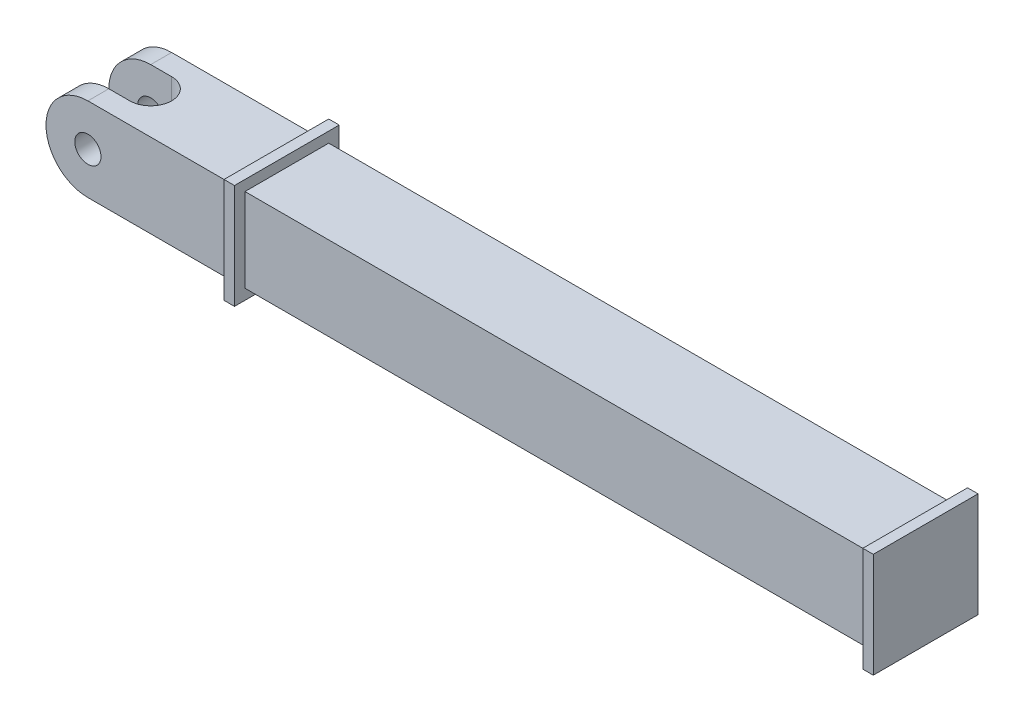
ISO-10303-21;
HEADER;
FILE_DESCRIPTION(('STEP AP214'),'2;1');
FILE_NAME('part.step','',(''),(''),'','','');
FILE_SCHEMA(('AUTOMOTIVE_DESIGN { 1 0 10303 214 1 1 1 1 }'));
ENDSEC;
DATA;
#1=APPLICATION_CONTEXT('core data for automotive mechanical design processes');
#2=APPLICATION_PROTOCOL_DEFINITION('international standard','automotive_design',2000,#1);
#3=PRODUCT_CONTEXT('',#1,'mechanical');
#4=PRODUCT('Part','Part','',(#3));
#5=PRODUCT_RELATED_PRODUCT_CATEGORY('part','',(#4));
#6=PRODUCT_DEFINITION_FORMATION('','',#4);
#7=PRODUCT_DEFINITION_CONTEXT('part definition',#1,'design');
#8=PRODUCT_DEFINITION('design','',#6,#7);
#9=PRODUCT_DEFINITION_SHAPE('','',#8);
#10=(LENGTH_UNIT() NAMED_UNIT(*) SI_UNIT(.MILLI.,.METRE.));
#11=(NAMED_UNIT(*) PLANE_ANGLE_UNIT() SI_UNIT($,.RADIAN.));
#12=(NAMED_UNIT(*) SI_UNIT($,.STERADIAN.) SOLID_ANGLE_UNIT());
#13=UNCERTAINTY_MEASURE_WITH_UNIT(LENGTH_MEASURE(1.E-05),#10,'distance_accuracy_value','');
#14=(GEOMETRIC_REPRESENTATION_CONTEXT(3) GLOBAL_UNCERTAINTY_ASSIGNED_CONTEXT((#13)) GLOBAL_UNIT_ASSIGNED_CONTEXT((#10,
#11,#12)) REPRESENTATION_CONTEXT('',''));
#15=CARTESIAN_POINT('',(0.,0.,0.));
#16=DIRECTION('',(0.,0.,1.));
#17=DIRECTION('',(1.,0.,0.));
#18=AXIS2_PLACEMENT_3D('',#15,#16,#17);
#19=CARTESIAN_POINT('',(0.,80.,0.));
#20=DIRECTION('',(0.,-1.,0.));
#21=DIRECTION('',(0.,0.,-1.));
#22=AXIS2_PLACEMENT_3D('',#19,#20,#21);
#23=PLANE('',#22);
#24=DIRECTION('',(1.,0.,0.));
#25=VECTOR('',#24,1.);
#26=CARTESIAN_POINT('',(-470.,80.,-20.));
#27=LINE('',#26,#25);
#28=CARTESIAN_POINT('',(-430.,80.,-20.));
#29=VERTEX_POINT('',#28);
#30=CARTESIAN_POINT('',(-410.,80.,-20.));
#31=VERTEX_POINT('',#30);
#32=EDGE_CURVE('E210',#29,#31,#27,.T.);
#33=ORIENTED_EDGE('',*,*,#32,.T.);
#34=CARTESIAN_POINT('',(-410.,80.,0.));
#35=DIRECTION('',(0.,-1.,0.));
#36=DIRECTION('',(0.,0.,-1.));
#37=AXIS2_PLACEMENT_3D('',#34,#35,#36);
#38=CIRCLE('',#37,20.);
#39=CARTESIAN_POINT('',(-410.,80.,19.9999999999999));
#40=VERTEX_POINT('',#39);
#41=EDGE_CURVE('E190',#31,#40,#38,.T.);
#42=ORIENTED_EDGE('',*,*,#41,.T.);
#43=DIRECTION('',(-1.,0.,0.));
#44=VECTOR('',#43,1.);
#45=CARTESIAN_POINT('',(-410.,80.,19.9999999999999));
#46=LINE('',#45,#44);
#47=CARTESIAN_POINT('',(-430.,80.,19.9999999999999));
#48=VERTEX_POINT('',#47);
#49=EDGE_CURVE('E186',#40,#48,#46,.T.);
#50=ORIENTED_EDGE('',*,*,#49,.T.);
#51=DIRECTION('',(0.,0.,1.));
#52=VECTOR('',#51,1.);
#53=CARTESIAN_POINT('',(-430.,80.,-153.137084989848));
#54=LINE('',#53,#52);
#55=CARTESIAN_POINT('',(-430.,80.,40.));
#56=VERTEX_POINT('',#55);
#57=EDGE_CURVE('E226',#48,#56,#54,.T.);
#58=ORIENTED_EDGE('',*,*,#57,.T.);
#59=DIRECTION('',(1.,0.,0.));
#60=VECTOR('',#59,1.);
#61=CARTESIAN_POINT('',(-330.,80.,40.));
#62=LINE('',#61,#60);
#63=CARTESIAN_POINT('',(-290.,80.,40.));
#64=VERTEX_POINT('',#63);
#65=EDGE_CURVE('E321',#56,#64,#62,.T.);
#66=ORIENTED_EDGE('',*,*,#65,.T.);
#67=DIRECTION('',(0.,0.,-1.));
#68=VECTOR('',#67,1.);
#69=CARTESIAN_POINT('',(-290.,80.,0.));
#70=LINE('',#69,#68);
#71=CARTESIAN_POINT('',(-290.,80.,-40.));
#72=VERTEX_POINT('',#71);
#73=EDGE_CURVE('E54',#64,#72,#70,.T.);
#74=ORIENTED_EDGE('',*,*,#73,.T.);
#75=DIRECTION('',(-1.,0.,0.));
#76=VECTOR('',#75,1.);
#77=CARTESIAN_POINT('',(-330.,80.,-40.));
#78=LINE('',#77,#76);
#79=CARTESIAN_POINT('',(-430.,80.,-40.));
#80=VERTEX_POINT('',#79);
#81=EDGE_CURVE('E320',#72,#80,#78,.T.);
#82=ORIENTED_EDGE('',*,*,#81,.T.);
#83=EDGE_CURVE('E229',#80,#29,#54,.T.);
#84=ORIENTED_EDGE('',*,*,#83,.T.);
#85=EDGE_LOOP('',(#33,#42,#50,#58,#66,#74,#82,#84));
#86=FACE_BOUND('',#85,.T.);
#87=ADVANCED_FACE('F37',(#86),#23,.F.);
#88=CARTESIAN_POINT('',(0.,0.,0.));
#89=DIRECTION('',(0.,-1.,0.));
#90=DIRECTION('',(0.,0.,-1.));
#91=AXIS2_PLACEMENT_3D('',#88,#89,#90);
#92=PLANE('',#91);
#93=CARTESIAN_POINT('',(-410.,0.,0.));
#94=DIRECTION('',(0.,-1.,0.));
#95=DIRECTION('',(0.,0.,-1.));
#96=AXIS2_PLACEMENT_3D('',#93,#94,#95);
#97=CIRCLE('',#96,20.);
#98=CARTESIAN_POINT('',(-410.,0.,-20.));
#99=VERTEX_POINT('',#98);
#100=CARTESIAN_POINT('',(-410.,0.,19.9999999999999));
#101=VERTEX_POINT('',#100);
#102=EDGE_CURVE('E194',#99,#101,#97,.T.);
#103=ORIENTED_EDGE('',*,*,#102,.F.);
#104=DIRECTION('',(1.,0.,0.));
#105=VECTOR('',#104,1.);
#106=CARTESIAN_POINT('',(-470.,0.,-20.));
#107=LINE('',#106,#105);
#108=CARTESIAN_POINT('',(-430.,0.,-20.));
#109=VERTEX_POINT('',#108);
#110=EDGE_CURVE('E199',#109,#99,#107,.T.);
#111=ORIENTED_EDGE('',*,*,#110,.F.);
#112=DIRECTION('',(0.,0.,1.));
#113=VECTOR('',#112,1.);
#114=CARTESIAN_POINT('',(-430.,0.,-153.137084989848));
#115=LINE('',#114,#113);
#116=CARTESIAN_POINT('',(-430.,0.,-40.));
#117=VERTEX_POINT('',#116);
#118=EDGE_CURVE('E220',#117,#109,#115,.T.);
#119=ORIENTED_EDGE('',*,*,#118,.F.);
#120=DIRECTION('',(-1.,0.,0.));
#121=VECTOR('',#120,1.);
#122=CARTESIAN_POINT('',(-330.,0.,-40.));
#123=LINE('',#122,#121);
#124=CARTESIAN_POINT('',(-290.,0.,-40.));
#125=VERTEX_POINT('',#124);
#126=EDGE_CURVE('E315',#125,#117,#123,.T.);
#127=ORIENTED_EDGE('',*,*,#126,.F.);
#128=DIRECTION('',(0.,0.,-1.));
#129=VECTOR('',#128,1.);
#130=CARTESIAN_POINT('',(-290.,0.,0.));
#131=LINE('',#130,#129);
#132=CARTESIAN_POINT('',(-290.,0.,40.));
#133=VERTEX_POINT('',#132);
#134=EDGE_CURVE('E11',#133,#125,#131,.T.);
#135=ORIENTED_EDGE('',*,*,#134,.F.);
#136=DIRECTION('',(1.,0.,0.));
#137=VECTOR('',#136,1.);
#138=CARTESIAN_POINT('',(-330.,0.,40.));
#139=LINE('',#138,#137);
#140=CARTESIAN_POINT('',(-430.,0.,40.));
#141=VERTEX_POINT('',#140);
#142=EDGE_CURVE('E328',#141,#133,#139,.T.);
#143=ORIENTED_EDGE('',*,*,#142,.F.);
#144=CARTESIAN_POINT('',(-430.,0.,19.9999999999999));
#145=VERTEX_POINT('',#144);
#146=EDGE_CURVE('E203',#145,#141,#115,.T.);
#147=ORIENTED_EDGE('',*,*,#146,.F.);
#148=DIRECTION('',(-1.,0.,0.));
#149=VECTOR('',#148,1.);
#150=CARTESIAN_POINT('',(-410.,0.,19.9999999999999));
#151=LINE('',#150,#149);
#152=EDGE_CURVE('E183',#101,#145,#151,.T.);
#153=ORIENTED_EDGE('',*,*,#152,.F.);
#154=EDGE_LOOP('',(#103,#111,#119,#127,#135,#143,#147,#153));
#155=FACE_BOUND('',#154,.T.);
#156=ADVANCED_FACE('F201',(#155),#92,.T.);
#157=CARTESIAN_POINT('',(-430.,40.,-153.137084989848));
#158=DIRECTION('',(0.,0.,1.));
#159=DIRECTION('',(1.,0.,0.));
#160=AXIS2_PLACEMENT_3D('',#157,#158,#159);
#161=CYLINDRICAL_SURFACE('',#160,40.);
#162=ORIENTED_EDGE('',*,*,#118,.T.);
#163=CARTESIAN_POINT('',(-430.,40.,-20.));
#164=DIRECTION('',(0.,0.,1.));
#165=DIRECTION('',(1.,0.,0.));
#166=AXIS2_PLACEMENT_3D('',#163,#164,#165);
#167=CIRCLE('',#166,40.);
#168=EDGE_CURVE('E213',#109,#29,#167,.F.);
#169=ORIENTED_EDGE('',*,*,#168,.T.);
#170=ORIENTED_EDGE('',*,*,#83,.F.);
#171=CARTESIAN_POINT('',(-430.,40.,-40.));
#172=DIRECTION('',(0.,0.,1.));
#173=DIRECTION('',(1.,0.,0.));
#174=AXIS2_PLACEMENT_3D('',#171,#172,#173);
#175=CIRCLE('',#174,40.);
#176=EDGE_CURVE('E216',#117,#80,#175,.F.);
#177=ORIENTED_EDGE('',*,*,#176,.F.);
#178=EDGE_LOOP('',(#162,#169,#170,#177));
#179=FACE_BOUND('',#178,.T.);
#180=ADVANCED_FACE('F369',(#179),#161,.T.);
#181=CARTESIAN_POINT('',(-430.,40.,19.9999999999999));
#182=DIRECTION('',(0.,0.,-1.));
#183=DIRECTION('',(-1.,0.,0.));
#184=AXIS2_PLACEMENT_3D('',#181,#182,#183);
#185=CIRCLE('',#184,40.);
#186=EDGE_CURVE('E207',#48,#145,#185,.F.);
#187=ORIENTED_EDGE('',*,*,#186,.T.);
#188=ORIENTED_EDGE('',*,*,#146,.T.);
#189=CARTESIAN_POINT('',(-430.,40.,40.));
#190=DIRECTION('',(0.,0.,1.));
#191=DIRECTION('',(1.,0.,0.));
#192=AXIS2_PLACEMENT_3D('',#189,#190,#191);
#193=CIRCLE('',#192,40.);
#194=EDGE_CURVE('E215',#56,#141,#193,.T.);
#195=ORIENTED_EDGE('',*,*,#194,.F.);
#196=ORIENTED_EDGE('',*,*,#57,.F.);
#197=EDGE_LOOP('',(#187,#188,#195,#196));
#198=FACE_BOUND('',#197,.T.);
#199=ADVANCED_FACE('F569',(#198),#161,.T.);
#200=CARTESIAN_POINT('',(-430.,40.,-153.137084989848));
#201=DIRECTION('',(0.,0.,1.));
#202=DIRECTION('',(1.,0.,0.));
#203=AXIS2_PLACEMENT_3D('',#200,#201,#202);
#204=CYLINDRICAL_SURFACE('',#203,12.5);
#205=CARTESIAN_POINT('',(-430.,40.,-40.));
#206=DIRECTION('',(0.,0.,1.));
#207=DIRECTION('',(1.,0.,0.));
#208=AXIS2_PLACEMENT_3D('',#205,#206,#207);
#209=CIRCLE('',#208,12.5);
#210=CARTESIAN_POINT('',(-417.5,40.,-40.));
#211=VERTEX_POINT('',#210);
#212=EDGE_CURVE('E219',#211,#211,#209,.F.);
#213=ORIENTED_EDGE('',*,*,#212,.T.);
#214=EDGE_LOOP('',(#213));
#215=FACE_BOUND('',#214,.T.);
#216=CARTESIAN_POINT('',(-430.,40.,-20.));
#217=DIRECTION('',(0.,0.,1.));
#218=DIRECTION('',(1.,0.,0.));
#219=AXIS2_PLACEMENT_3D('',#216,#217,#218);
#220=CIRCLE('',#219,12.5);
#221=CARTESIAN_POINT('',(-417.5,40.,-20.));
#222=VERTEX_POINT('',#221);
#223=EDGE_CURVE('E41',#222,#222,#220,.F.);
#224=ORIENTED_EDGE('',*,*,#223,.F.);
#225=EDGE_LOOP('',(#224));
#226=FACE_BOUND('',#225,.T.);
#227=ADVANCED_FACE('F578',(#215,#226),#204,.F.);
#228=CARTESIAN_POINT('',(-430.,40.,40.));
#229=DIRECTION('',(0.,0.,1.));
#230=DIRECTION('',(1.,0.,0.));
#231=AXIS2_PLACEMENT_3D('',#228,#229,#230);
#232=CIRCLE('',#231,12.5);
#233=CARTESIAN_POINT('',(-417.5,40.,40.));
#234=VERTEX_POINT('',#233);
#235=EDGE_CURVE('E223',#234,#234,#232,.T.);
#236=ORIENTED_EDGE('',*,*,#235,.T.);
#237=EDGE_LOOP('',(#236));
#238=FACE_BOUND('',#237,.T.);
#239=CARTESIAN_POINT('',(-430.,40.,19.9999999999999));
#240=DIRECTION('',(0.,0.,-1.));
#241=DIRECTION('',(-1.,0.,0.));
#242=AXIS2_PLACEMENT_3D('',#239,#240,#241);
#243=CIRCLE('',#242,12.5);
#244=CARTESIAN_POINT('',(-442.5,40.,19.9999999999999));
#245=VERTEX_POINT('',#244);
#246=EDGE_CURVE('E204',#245,#245,#243,.F.);
#247=ORIENTED_EDGE('',*,*,#246,.F.);
#248=EDGE_LOOP('',(#247));
#249=FACE_BOUND('',#248,.T.);
#250=ADVANCED_FACE('F478',(#238,#249),#204,.F.);
#251=CARTESIAN_POINT('',(-330.,80.,-40.));
#252=DIRECTION('',(0.,0.,1.));
#253=DIRECTION('',(1.,0.,0.));
#254=AXIS2_PLACEMENT_3D('',#251,#252,#253);
#255=PLANE('',#254);
#256=DIRECTION('',(0.,-1.,0.));
#257=VECTOR('',#256,1.);
#258=CARTESIAN_POINT('',(-280.,80.,-40.));
#259=LINE('',#258,#257);
#260=CARTESIAN_POINT('',(-280.,80.,-40.));
#261=VERTEX_POINT('',#260);
#262=CARTESIAN_POINT('',(-280.,0.,-40.));
#263=VERTEX_POINT('',#262);
#264=EDGE_CURVE('E268',#261,#263,#259,.T.);
#265=ORIENTED_EDGE('',*,*,#264,.F.);
#266=CARTESIAN_POINT('',(320.,80.,-40.));
#267=VERTEX_POINT('',#266);
#268=EDGE_CURVE('E316',#267,#261,#78,.T.);
#269=ORIENTED_EDGE('',*,*,#268,.F.);
#270=DIRECTION('',(0.,-1.,0.));
#271=VECTOR('',#270,1.);
#272=CARTESIAN_POINT('',(320.,80.,-40.));
#273=LINE('',#272,#271);
#274=CARTESIAN_POINT('',(320.,0.,-40.));
#275=VERTEX_POINT('',#274);
#276=EDGE_CURVE('E310',#267,#275,#273,.T.);
#277=ORIENTED_EDGE('',*,*,#276,.T.);
#278=EDGE_CURVE('E324',#275,#263,#123,.T.);
#279=ORIENTED_EDGE('',*,*,#278,.T.);
#280=EDGE_LOOP('',(#265,#269,#277,#279));
#281=FACE_BOUND('',#280,.T.);
#282=ADVANCED_FACE('F341',(#281),#255,.F.);
#283=CARTESIAN_POINT('',(-330.,80.,40.));
#284=DIRECTION('',(0.,0.,-1.));
#285=DIRECTION('',(-1.,0.,0.));
#286=AXIS2_PLACEMENT_3D('',#283,#284,#285);
#287=PLANE('',#286);
#288=DIRECTION('',(0.,1.,0.));
#289=VECTOR('',#288,1.);
#290=CARTESIAN_POINT('',(-280.,80.,40.));
#291=LINE('',#290,#289);
#292=CARTESIAN_POINT('',(-280.,0.,40.));
#293=VERTEX_POINT('',#292);
#294=CARTESIAN_POINT('',(-280.,80.,40.));
#295=VERTEX_POINT('',#294);
#296=EDGE_CURVE('E266',#293,#295,#291,.T.);
#297=ORIENTED_EDGE('',*,*,#296,.F.);
#298=CARTESIAN_POINT('',(320.,0.,40.));
#299=VERTEX_POINT('',#298);
#300=EDGE_CURVE('E327',#293,#299,#139,.T.);
#301=ORIENTED_EDGE('',*,*,#300,.T.);
#302=DIRECTION('',(0.,1.,0.));
#303=VECTOR('',#302,1.);
#304=CARTESIAN_POINT('',(320.,80.,40.));
#305=LINE('',#304,#303);
#306=CARTESIAN_POINT('',(320.,80.,40.));
#307=VERTEX_POINT('',#306);
#308=EDGE_CURVE('E301',#299,#307,#305,.T.);
#309=ORIENTED_EDGE('',*,*,#308,.T.);
#310=EDGE_CURVE('E319',#295,#307,#62,.T.);
#311=ORIENTED_EDGE('',*,*,#310,.F.);
#312=EDGE_LOOP('',(#297,#301,#309,#311));
#313=FACE_BOUND('',#312,.T.);
#314=ADVANCED_FACE('F350',(#313),#287,.F.);
#315=DIRECTION('',(0.,0.,-1.));
#316=VECTOR('',#315,1.);
#317=CARTESIAN_POINT('',(-280.,80.,0.));
#318=LINE('',#317,#316);
#319=EDGE_CURVE('E270',#295,#261,#318,.T.);
#320=ORIENTED_EDGE('',*,*,#319,.F.);
#321=ORIENTED_EDGE('',*,*,#310,.T.);
#322=DIRECTION('',(0.,0.,-1.));
#323=VECTOR('',#322,1.);
#324=CARTESIAN_POINT('',(320.,80.,0.));
#325=LINE('',#324,#323);
#326=EDGE_CURVE('E313',#307,#267,#325,.T.);
#327=ORIENTED_EDGE('',*,*,#326,.T.);
#328=ORIENTED_EDGE('',*,*,#268,.T.);
#329=EDGE_LOOP('',(#320,#321,#327,#328));
#330=FACE_BOUND('',#329,.T.);
#331=ADVANCED_FACE('F354',(#330),#23,.F.);
#332=ORIENTED_EDGE('',*,*,#300,.F.);
#333=DIRECTION('',(0.,0.,-1.));
#334=VECTOR('',#333,1.);
#335=CARTESIAN_POINT('',(-280.,0.,0.));
#336=LINE('',#335,#334);
#337=EDGE_CURVE('E46',#293,#263,#336,.T.);
#338=ORIENTED_EDGE('',*,*,#337,.T.);
#339=ORIENTED_EDGE('',*,*,#278,.F.);
#340=DIRECTION('',(0.,0.,-1.));
#341=VECTOR('',#340,1.);
#342=CARTESIAN_POINT('',(320.,0.,0.));
#343=LINE('',#342,#341);
#344=EDGE_CURVE('E323',#299,#275,#343,.T.);
#345=ORIENTED_EDGE('',*,*,#344,.F.);
#346=EDGE_LOOP('',(#332,#338,#339,#345));
#347=FACE_BOUND('',#346,.T.);
#348=ADVANCED_FACE('F335',(#347),#92,.T.);
#349=CARTESIAN_POINT('',(320.,0.,0.));
#350=DIRECTION('',(-1.,0.,0.));
#351=DIRECTION('',(0.,0.,1.));
#352=AXIS2_PLACEMENT_3D('',#349,#350,#351);
#353=PLANE('',#352);
#354=DIRECTION('',(0.,0.,-1.));
#355=VECTOR('',#354,1.);
#356=CARTESIAN_POINT('',(320.,90.,50.));
#357=LINE('',#356,#355);
#358=CARTESIAN_POINT('',(320.,90.,50.));
#359=VERTEX_POINT('',#358);
#360=CARTESIAN_POINT('',(320.,90.,-50.));
#361=VERTEX_POINT('',#360);
#362=EDGE_CURVE('E277',#359,#361,#357,.T.);
#363=ORIENTED_EDGE('',*,*,#362,.T.);
#364=DIRECTION('',(0.,-1.,0.));
#365=VECTOR('',#364,1.);
#366=CARTESIAN_POINT('',(320.,90.,-50.));
#367=LINE('',#366,#365);
#368=CARTESIAN_POINT('',(320.,-9.99999999999999,-50.));
#369=VERTEX_POINT('',#368);
#370=EDGE_CURVE('E292',#361,#369,#367,.T.);
#371=ORIENTED_EDGE('',*,*,#370,.T.);
#372=DIRECTION('',(0.,0.,-1.));
#373=VECTOR('',#372,1.);
#374=CARTESIAN_POINT('',(320.,-10.,50.));
#375=LINE('',#374,#373);
#376=CARTESIAN_POINT('',(320.,-10.,50.));
#377=VERTEX_POINT('',#376);
#378=EDGE_CURVE('E295',#377,#369,#375,.T.);
#379=ORIENTED_EDGE('',*,*,#378,.F.);
#380=DIRECTION('',(0.,-1.,0.));
#381=VECTOR('',#380,1.);
#382=CARTESIAN_POINT('',(320.,90.,50.));
#383=LINE('',#382,#381);
#384=EDGE_CURVE('E282',#359,#377,#383,.T.);
#385=ORIENTED_EDGE('',*,*,#384,.F.);
#386=EDGE_LOOP('',(#363,#371,#379,#385));
#387=FACE_BOUND('',#386,.T.);
#388=ORIENTED_EDGE('',*,*,#326,.F.);
#389=ORIENTED_EDGE('',*,*,#308,.F.);
#390=ORIENTED_EDGE('',*,*,#344,.T.);
#391=ORIENTED_EDGE('',*,*,#276,.F.);
#392=EDGE_LOOP('',(#388,#389,#390,#391));
#393=FACE_BOUND('',#392,.T.);
#394=ADVANCED_FACE('F347',(#387,#393),#353,.T.);
#395=CARTESIAN_POINT('',(330.,90.,50.));
#396=DIRECTION('',(0.,1.,0.));
#397=DIRECTION('',(0.,0.,1.));
#398=AXIS2_PLACEMENT_3D('',#395,#396,#397);
#399=PLANE('',#398);
#400=ORIENTED_EDGE('',*,*,#362,.F.);
#401=DIRECTION('',(-1.,0.,0.));
#402=VECTOR('',#401,1.);
#403=CARTESIAN_POINT('',(330.,90.,50.));
#404=LINE('',#403,#402);
#405=CARTESIAN_POINT('',(330.,90.,50.));
#406=VERTEX_POINT('',#405);
#407=EDGE_CURVE('E299',#406,#359,#404,.T.);
#408=ORIENTED_EDGE('',*,*,#407,.F.);
#409=DIRECTION('',(0.,0.,-1.));
#410=VECTOR('',#409,1.);
#411=CARTESIAN_POINT('',(330.,90.,50.));
#412=LINE('',#411,#410);
#413=CARTESIAN_POINT('',(330.,90.,-50.));
#414=VERTEX_POINT('',#413);
#415=EDGE_CURVE('E278',#406,#414,#412,.T.);
#416=ORIENTED_EDGE('',*,*,#415,.T.);
#417=DIRECTION('',(-1.,0.,0.));
#418=VECTOR('',#417,1.);
#419=CARTESIAN_POINT('',(330.,90.,-50.));
#420=LINE('',#419,#418);
#421=EDGE_CURVE('E289',#414,#361,#420,.T.);
#422=ORIENTED_EDGE('',*,*,#421,.T.);
#423=EDGE_LOOP('',(#400,#408,#416,#422));
#424=FACE_BOUND('',#423,.T.);
#425=ADVANCED_FACE('F423',(#424),#399,.T.);
#426=CARTESIAN_POINT('',(330.,90.,50.));
#427=DIRECTION('',(0.,0.,-1.));
#428=DIRECTION('',(-1.,0.,0.));
#429=AXIS2_PLACEMENT_3D('',#426,#427,#428);
#430=PLANE('',#429);
#431=ORIENTED_EDGE('',*,*,#384,.T.);
#432=DIRECTION('',(-1.,0.,0.));
#433=VECTOR('',#432,1.);
#434=CARTESIAN_POINT('',(330.,-10.,50.));
#435=LINE('',#434,#433);
#436=CARTESIAN_POINT('',(330.,-10.,50.));
#437=VERTEX_POINT('',#436);
#438=EDGE_CURVE('E302',#437,#377,#435,.T.);
#439=ORIENTED_EDGE('',*,*,#438,.F.);
#440=DIRECTION('',(0.,-1.,0.));
#441=VECTOR('',#440,1.);
#442=CARTESIAN_POINT('',(330.,90.,50.));
#443=LINE('',#442,#441);
#444=EDGE_CURVE('E287',#406,#437,#443,.T.);
#445=ORIENTED_EDGE('',*,*,#444,.F.);
#446=ORIENTED_EDGE('',*,*,#407,.T.);
#447=EDGE_LOOP('',(#431,#439,#445,#446));
#448=FACE_BOUND('',#447,.T.);
#449=ADVANCED_FACE('F425',(#448),#430,.F.);
#450=CARTESIAN_POINT('',(330.,-10.,50.));
#451=DIRECTION('',(0.,1.,0.));
#452=DIRECTION('',(0.,0.,1.));
#453=AXIS2_PLACEMENT_3D('',#450,#451,#452);
#454=PLANE('',#453);
#455=ORIENTED_EDGE('',*,*,#378,.T.);
#456=DIRECTION('',(-1.,0.,0.));
#457=VECTOR('',#456,1.);
#458=CARTESIAN_POINT('',(330.,-9.99999999999999,-50.));
#459=LINE('',#458,#457);
#460=CARTESIAN_POINT('',(330.,-9.99999999999999,-50.));
#461=VERTEX_POINT('',#460);
#462=EDGE_CURVE('E305',#461,#369,#459,.T.);
#463=ORIENTED_EDGE('',*,*,#462,.F.);
#464=DIRECTION('',(0.,0.,-1.));
#465=VECTOR('',#464,1.);
#466=CARTESIAN_POINT('',(330.,-10.,50.));
#467=LINE('',#466,#465);
#468=EDGE_CURVE('E285',#437,#461,#467,.T.);
#469=ORIENTED_EDGE('',*,*,#468,.F.);
#470=ORIENTED_EDGE('',*,*,#438,.T.);
#471=EDGE_LOOP('',(#455,#463,#469,#470));
#472=FACE_BOUND('',#471,.T.);
#473=ADVANCED_FACE('F428',(#472),#454,.F.);
#474=CARTESIAN_POINT('',(330.,90.,-50.));
#475=DIRECTION('',(0.,0.,-1.));
#476=DIRECTION('',(0.,1.,0.));
#477=AXIS2_PLACEMENT_3D('',#474,#475,#476);
#478=PLANE('',#477);
#479=ORIENTED_EDGE('',*,*,#370,.F.);
#480=ORIENTED_EDGE('',*,*,#421,.F.);
#481=DIRECTION('',(0.,-1.,0.));
#482=VECTOR('',#481,1.);
#483=CARTESIAN_POINT('',(330.,90.,-50.));
#484=LINE('',#483,#482);
#485=EDGE_CURVE('E281',#414,#461,#484,.T.);
#486=ORIENTED_EDGE('',*,*,#485,.T.);
#487=ORIENTED_EDGE('',*,*,#462,.T.);
#488=EDGE_LOOP('',(#479,#480,#486,#487));
#489=FACE_BOUND('',#488,.T.);
#490=ADVANCED_FACE('F401',(#489),#478,.T.);
#491=CARTESIAN_POINT('',(330.,80.,40.));
#492=DIRECTION('',(-1.,0.,0.));
#493=DIRECTION('',(0.,0.,1.));
#494=AXIS2_PLACEMENT_3D('',#491,#492,#493);
#495=PLANE('',#494);
#496=ORIENTED_EDGE('',*,*,#415,.F.);
#497=ORIENTED_EDGE('',*,*,#444,.T.);
#498=ORIENTED_EDGE('',*,*,#468,.T.);
#499=ORIENTED_EDGE('',*,*,#485,.F.);
#500=EDGE_LOOP('',(#496,#497,#498,#499));
#501=FACE_BOUND('',#500,.T.);
#502=ADVANCED_FACE('F39',(#501),#495,.F.);
#503=CARTESIAN_POINT('',(-290.,0.,0.));
#504=DIRECTION('',(-1.,0.,0.));
#505=DIRECTION('',(0.,0.,1.));
#506=AXIS2_PLACEMENT_3D('',#503,#504,#505);
#507=PLANE('',#506);
#508=DIRECTION('',(0.,0.,-1.));
#509=VECTOR('',#508,1.);
#510=CARTESIAN_POINT('',(-290.,90.,50.));
#511=LINE('',#510,#509);
#512=CARTESIAN_POINT('',(-290.,90.,50.));
#513=VERTEX_POINT('',#512);
#514=CARTESIAN_POINT('',(-290.,90.,-50.));
#515=VERTEX_POINT('',#514);
#516=EDGE_CURVE('E235',#513,#515,#511,.T.);
#517=ORIENTED_EDGE('',*,*,#516,.T.);
#518=DIRECTION('',(0.,-1.,0.));
#519=VECTOR('',#518,1.);
#520=CARTESIAN_POINT('',(-290.,90.,-50.));
#521=LINE('',#520,#519);
#522=CARTESIAN_POINT('',(-290.,-9.99999999999999,-50.));
#523=VERTEX_POINT('',#522);
#524=EDGE_CURVE('E238',#515,#523,#521,.T.);
#525=ORIENTED_EDGE('',*,*,#524,.T.);
#526=DIRECTION('',(0.,0.,-1.));
#527=VECTOR('',#526,1.);
#528=CARTESIAN_POINT('',(-290.,-10.,50.));
#529=LINE('',#528,#527);
#530=CARTESIAN_POINT('',(-290.,-10.,50.));
#531=VERTEX_POINT('',#530);
#532=EDGE_CURVE('E241',#531,#523,#529,.T.);
#533=ORIENTED_EDGE('',*,*,#532,.F.);
#534=DIRECTION('',(0.,-1.,0.));
#535=VECTOR('',#534,1.);
#536=CARTESIAN_POINT('',(-290.,90.,50.));
#537=LINE('',#536,#535);
#538=EDGE_CURVE('E244',#513,#531,#537,.T.);
#539=ORIENTED_EDGE('',*,*,#538,.F.);
#540=EDGE_LOOP('',(#517,#525,#533,#539));
#541=FACE_BOUND('',#540,.T.);
#542=ORIENTED_EDGE('',*,*,#73,.F.);
#543=DIRECTION('',(0.,1.,0.));
#544=VECTOR('',#543,1.);
#545=CARTESIAN_POINT('',(-290.,80.,40.));
#546=LINE('',#545,#544);
#547=EDGE_CURVE('E62',#133,#64,#546,.T.);
#548=ORIENTED_EDGE('',*,*,#547,.F.);
#549=ORIENTED_EDGE('',*,*,#134,.T.);
#550=DIRECTION('',(0.,-1.,0.));
#551=VECTOR('',#550,1.);
#552=CARTESIAN_POINT('',(-290.,80.,-40.));
#553=LINE('',#552,#551);
#554=EDGE_CURVE('E273',#72,#125,#553,.T.);
#555=ORIENTED_EDGE('',*,*,#554,.F.);
#556=EDGE_LOOP('',(#542,#548,#549,#555));
#557=FACE_BOUND('',#556,.T.);
#558=ADVANCED_FACE('F390',(#541,#557),#507,.T.);
#559=CARTESIAN_POINT('',(-280.,0.,0.));
#560=DIRECTION('',(-1.,0.,0.));
#561=DIRECTION('',(0.,0.,1.));
#562=AXIS2_PLACEMENT_3D('',#559,#560,#561);
#563=PLANE('',#562);
#564=DIRECTION('',(0.,0.,-1.));
#565=VECTOR('',#564,1.);
#566=CARTESIAN_POINT('',(-280.,90.,50.));
#567=LINE('',#566,#565);
#568=CARTESIAN_POINT('',(-280.,90.,50.));
#569=VERTEX_POINT('',#568);
#570=CARTESIAN_POINT('',(-280.,90.,-50.));
#571=VERTEX_POINT('',#570);
#572=EDGE_CURVE('E234',#569,#571,#567,.T.);
#573=ORIENTED_EDGE('',*,*,#572,.F.);
#574=DIRECTION('',(0.,-1.,0.));
#575=VECTOR('',#574,1.);
#576=CARTESIAN_POINT('',(-280.,90.,50.));
#577=LINE('',#576,#575);
#578=CARTESIAN_POINT('',(-280.,-10.,50.));
#579=VERTEX_POINT('',#578);
#580=EDGE_CURVE('E239',#569,#579,#577,.T.);
#581=ORIENTED_EDGE('',*,*,#580,.T.);
#582=DIRECTION('',(0.,0.,-1.));
#583=VECTOR('',#582,1.);
#584=CARTESIAN_POINT('',(-280.,-10.,50.));
#585=LINE('',#584,#583);
#586=CARTESIAN_POINT('',(-280.,-9.99999999999999,-50.));
#587=VERTEX_POINT('',#586);
#588=EDGE_CURVE('E253',#579,#587,#585,.T.);
#589=ORIENTED_EDGE('',*,*,#588,.T.);
#590=DIRECTION('',(0.,-1.,0.));
#591=VECTOR('',#590,1.);
#592=CARTESIAN_POINT('',(-280.,90.,-50.));
#593=LINE('',#592,#591);
#594=EDGE_CURVE('E250',#571,#587,#593,.T.);
#595=ORIENTED_EDGE('',*,*,#594,.F.);
#596=EDGE_LOOP('',(#573,#581,#589,#595));
#597=FACE_BOUND('',#596,.T.);
#598=ORIENTED_EDGE('',*,*,#296,.T.);
#599=ORIENTED_EDGE('',*,*,#319,.T.);
#600=ORIENTED_EDGE('',*,*,#264,.T.);
#601=ORIENTED_EDGE('',*,*,#337,.F.);
#602=EDGE_LOOP('',(#598,#599,#600,#601));
#603=FACE_BOUND('',#602,.T.);
#604=ADVANCED_FACE('F352',(#597,#603),#563,.F.);
#605=CARTESIAN_POINT('',(-290.,90.,50.));
#606=DIRECTION('',(0.,-1.,0.));
#607=DIRECTION('',(0.,0.,-1.));
#608=AXIS2_PLACEMENT_3D('',#605,#606,#607);
#609=PLANE('',#608);
#610=ORIENTED_EDGE('',*,*,#572,.T.);
#611=DIRECTION('',(1.,0.,0.));
#612=VECTOR('',#611,1.);
#613=CARTESIAN_POINT('',(-290.,90.,-50.));
#614=LINE('',#613,#612);
#615=EDGE_CURVE('E263',#515,#571,#614,.T.);
#616=ORIENTED_EDGE('',*,*,#615,.F.);
#617=ORIENTED_EDGE('',*,*,#516,.F.);
#618=DIRECTION('',(1.,0.,0.));
#619=VECTOR('',#618,1.);
#620=CARTESIAN_POINT('',(-290.,90.,50.));
#621=LINE('',#620,#619);
#622=EDGE_CURVE('E247',#513,#569,#621,.T.);
#623=ORIENTED_EDGE('',*,*,#622,.T.);
#624=EDGE_LOOP('',(#610,#616,#617,#623));
#625=FACE_BOUND('',#624,.T.);
#626=ADVANCED_FACE('F398',(#625),#609,.F.);
#627=CARTESIAN_POINT('',(-290.,90.,-50.));
#628=DIRECTION('',(0.,0.,1.));
#629=DIRECTION('',(0.,-1.,0.));
#630=AXIS2_PLACEMENT_3D('',#627,#628,#629);
#631=PLANE('',#630);
#632=ORIENTED_EDGE('',*,*,#594,.T.);
#633=DIRECTION('',(1.,0.,0.));
#634=VECTOR('',#633,1.);
#635=CARTESIAN_POINT('',(-290.,-9.99999999999999,-50.));
#636=LINE('',#635,#634);
#637=EDGE_CURVE('E261',#523,#587,#636,.T.);
#638=ORIENTED_EDGE('',*,*,#637,.F.);
#639=ORIENTED_EDGE('',*,*,#524,.F.);
#640=ORIENTED_EDGE('',*,*,#615,.T.);
#641=EDGE_LOOP('',(#632,#638,#639,#640));
#642=FACE_BOUND('',#641,.T.);
#643=ADVANCED_FACE('F413',(#642),#631,.F.);
#644=CARTESIAN_POINT('',(-290.,-10.,50.));
#645=DIRECTION('',(0.,-1.,0.));
#646=DIRECTION('',(0.,0.,-1.));
#647=AXIS2_PLACEMENT_3D('',#644,#645,#646);
#648=PLANE('',#647);
#649=ORIENTED_EDGE('',*,*,#588,.F.);
#650=DIRECTION('',(1.,0.,0.));
#651=VECTOR('',#650,1.);
#652=CARTESIAN_POINT('',(-290.,-10.,50.));
#653=LINE('',#652,#651);
#654=EDGE_CURVE('E259',#531,#579,#653,.T.);
#655=ORIENTED_EDGE('',*,*,#654,.F.);
#656=ORIENTED_EDGE('',*,*,#532,.T.);
#657=ORIENTED_EDGE('',*,*,#637,.T.);
#658=EDGE_LOOP('',(#649,#655,#656,#657));
#659=FACE_BOUND('',#658,.T.);
#660=ADVANCED_FACE('F409',(#659),#648,.T.);
#661=CARTESIAN_POINT('',(-290.,90.,50.));
#662=DIRECTION('',(0.,0.,1.));
#663=DIRECTION('',(1.,0.,0.));
#664=AXIS2_PLACEMENT_3D('',#661,#662,#663);
#665=PLANE('',#664);
#666=ORIENTED_EDGE('',*,*,#580,.F.);
#667=ORIENTED_EDGE('',*,*,#622,.F.);
#668=ORIENTED_EDGE('',*,*,#538,.T.);
#669=ORIENTED_EDGE('',*,*,#654,.T.);
#670=EDGE_LOOP('',(#666,#667,#668,#669));
#671=FACE_BOUND('',#670,.T.);
#672=ADVANCED_FACE('F406',(#671),#665,.T.);
#673=ORIENTED_EDGE('',*,*,#142,.T.);
#674=ORIENTED_EDGE('',*,*,#547,.T.);
#675=ORIENTED_EDGE('',*,*,#65,.F.);
#676=ORIENTED_EDGE('',*,*,#194,.T.);
#677=EDGE_LOOP('',(#673,#674,#675,#676));
#678=FACE_BOUND('',#677,.T.);
#679=ORIENTED_EDGE('',*,*,#235,.F.);
#680=EDGE_LOOP('',(#679));
#681=FACE_BOUND('',#680,.T.);
#682=ADVANCED_FACE('F363',(#678,#681),#287,.F.);
#683=ORIENTED_EDGE('',*,*,#81,.F.);
#684=ORIENTED_EDGE('',*,*,#554,.T.);
#685=ORIENTED_EDGE('',*,*,#126,.T.);
#686=ORIENTED_EDGE('',*,*,#176,.T.);
#687=EDGE_LOOP('',(#683,#684,#685,#686));
#688=FACE_BOUND('',#687,.T.);
#689=ORIENTED_EDGE('',*,*,#212,.F.);
#690=EDGE_LOOP('',(#689));
#691=FACE_BOUND('',#690,.T.);
#692=ADVANCED_FACE('F384',(#688,#691),#255,.F.);
#693=CARTESIAN_POINT('',(-470.,-89.4427190999916,-20.));
#694=DIRECTION('',(0.,0.,1.));
#695=DIRECTION('',(1.,0.,0.));
#696=AXIS2_PLACEMENT_3D('',#693,#694,#695);
#697=PLANE('',#696);
#698=ORIENTED_EDGE('',*,*,#110,.T.);
#699=DIRECTION('',(0.,1.,0.));
#700=VECTOR('',#699,1.);
#701=CARTESIAN_POINT('',(-410.,-89.4427190999916,-20.));
#702=LINE('',#701,#700);
#703=EDGE_CURVE('E196',#99,#31,#702,.T.);
#704=ORIENTED_EDGE('',*,*,#703,.T.);
#705=ORIENTED_EDGE('',*,*,#32,.F.);
#706=ORIENTED_EDGE('',*,*,#168,.F.);
#707=EDGE_LOOP('',(#698,#704,#705,#706));
#708=FACE_BOUND('',#707,.T.);
#709=ORIENTED_EDGE('',*,*,#223,.T.);
#710=EDGE_LOOP('',(#709));
#711=FACE_BOUND('',#710,.T.);
#712=ADVANCED_FACE('F378',(#708,#711),#697,.T.);
#713=CARTESIAN_POINT('',(-410.,-89.4427190999916,19.9999999999999));
#714=DIRECTION('',(0.,0.,-1.));
#715=DIRECTION('',(-1.,0.,0.));
#716=AXIS2_PLACEMENT_3D('',#713,#714,#715);
#717=PLANE('',#716);
#718=ORIENTED_EDGE('',*,*,#186,.F.);
#719=ORIENTED_EDGE('',*,*,#49,.F.);
#720=DIRECTION('',(0.,1.,0.));
#721=VECTOR('',#720,1.);
#722=CARTESIAN_POINT('',(-410.,-89.4427190999916,19.9999999999999));
#723=LINE('',#722,#721);
#724=EDGE_CURVE('E178',#101,#40,#723,.T.);
#725=ORIENTED_EDGE('',*,*,#724,.F.);
#726=ORIENTED_EDGE('',*,*,#152,.T.);
#727=EDGE_LOOP('',(#718,#719,#725,#726));
#728=FACE_BOUND('',#727,.T.);
#729=ORIENTED_EDGE('',*,*,#246,.T.);
#730=EDGE_LOOP('',(#729));
#731=FACE_BOUND('',#730,.T.);
#732=ADVANCED_FACE('F180',(#728,#731),#717,.T.);
#733=CARTESIAN_POINT('',(-410.,-89.4427190999916,0.));
#734=DIRECTION('',(0.,1.,0.));
#735=DIRECTION('',(0.,0.,1.));
#736=AXIS2_PLACEMENT_3D('',#733,#734,#735);
#737=CYLINDRICAL_SURFACE('',#736,20.);
#738=ORIENTED_EDGE('',*,*,#102,.T.);
#739=ORIENTED_EDGE('',*,*,#724,.T.);
#740=ORIENTED_EDGE('',*,*,#41,.F.);
#741=ORIENTED_EDGE('',*,*,#703,.F.);
#742=EDGE_LOOP('',(#738,#739,#740,#741));
#743=FACE_BOUND('',#742,.T.);
#744=ADVANCED_FACE('F195',(#743),#737,.F.);
#745=CLOSED_SHELL('',(#87,#156,#180,#199,#227,#250,#282,#314,#331,#348,#394,#425,#449,#473,#490,
#502,#558,#604,#626,#643,#660,#672,#682,#692,#712,#732,#744));
#746=MANIFOLD_SOLID_BREP('B2',#745);
#747=ADVANCED_BREP_SHAPE_REPRESENTATION('',(#18,#746),#14);
#748=SHAPE_DEFINITION_REPRESENTATION(#9,#747);
ENDSEC;
END-ISO-10303-21;
